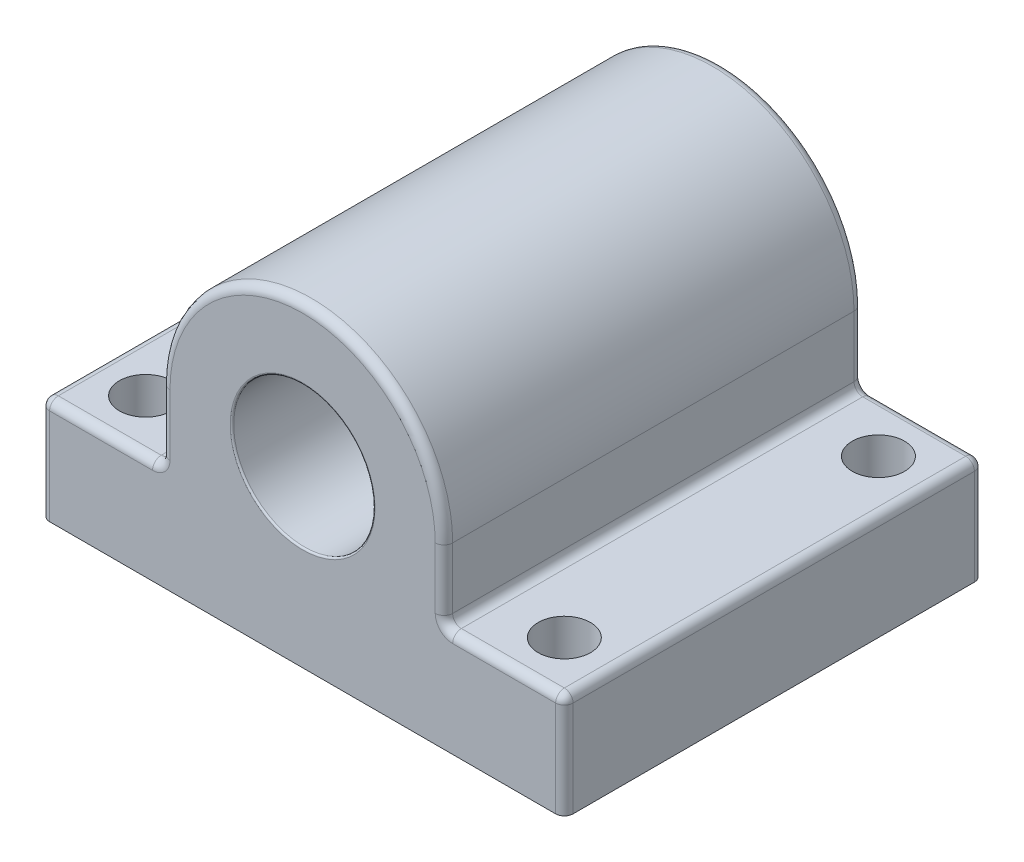
ISO-10303-21;
HEADER;
FILE_DESCRIPTION(('STEP AP214'),'2;1');
FILE_NAME('part.step','',(''),(''),'','','');
FILE_SCHEMA(('AUTOMOTIVE_DESIGN { 1 0 10303 214 1 1 1 1 }'));
ENDSEC;
DATA;
#1=APPLICATION_CONTEXT('core data for automotive mechanical design processes');
#2=APPLICATION_PROTOCOL_DEFINITION('international standard','automotive_design',2000,#1);
#3=PRODUCT_CONTEXT('',#1,'mechanical');
#4=PRODUCT('Part','Part','',(#3));
#5=PRODUCT_RELATED_PRODUCT_CATEGORY('part','',(#4));
#6=PRODUCT_DEFINITION_FORMATION('','',#4);
#7=PRODUCT_DEFINITION_CONTEXT('part definition',#1,'design');
#8=PRODUCT_DEFINITION('design','',#6,#7);
#9=PRODUCT_DEFINITION_SHAPE('','',#8);
#10=(LENGTH_UNIT() NAMED_UNIT(*) SI_UNIT(.MILLI.,.METRE.));
#11=(NAMED_UNIT(*) PLANE_ANGLE_UNIT() SI_UNIT($,.RADIAN.));
#12=(NAMED_UNIT(*) SI_UNIT($,.STERADIAN.) SOLID_ANGLE_UNIT());
#13=UNCERTAINTY_MEASURE_WITH_UNIT(LENGTH_MEASURE(1.E-05),#10,'distance_accuracy_value','');
#14=(GEOMETRIC_REPRESENTATION_CONTEXT(3) GLOBAL_UNCERTAINTY_ASSIGNED_CONTEXT((#13)) GLOBAL_UNIT_ASSIGNED_CONTEXT((#10,
#11,#12)) REPRESENTATION_CONTEXT('',''));
#15=CARTESIAN_POINT('',(0.,0.,0.));
#16=DIRECTION('',(0.,0.,1.));
#17=DIRECTION('',(1.,0.,0.));
#18=AXIS2_PLACEMENT_3D('',#15,#16,#17);
#19=CARTESIAN_POINT('',(8.10000000000001,0.,-12.));
#20=DIRECTION('',(-1.,0.,0.));
#21=DIRECTION('',(0.,-1.,0.));
#22=AXIS2_PLACEMENT_3D('',#19,#20,#21);
#23=PLANE('',#22);
#24=DIRECTION('',(0.,0.,1.));
#25=VECTOR('',#24,1.);
#26=CARTESIAN_POINT('',(8.1,10.,-12.));
#27=LINE('',#26,#25);
#28=CARTESIAN_POINT('',(8.1,10.,-11.5));
#29=VERTEX_POINT('',#28);
#30=CARTESIAN_POINT('',(8.1,10.,11.5));
#31=VERTEX_POINT('',#30);
#32=EDGE_CURVE('E229',#29,#31,#27,.T.);
#33=ORIENTED_EDGE('',*,*,#32,.T.);
#34=DIRECTION('',(0.,-1.,0.));
#35=VECTOR('',#34,1.);
#36=CARTESIAN_POINT('',(8.1,6.,11.5));
#37=LINE('',#36,#35);
#38=CARTESIAN_POINT('',(8.1,6.5,11.5));
#39=VERTEX_POINT('',#38);
#40=EDGE_CURVE('E259',#31,#39,#37,.T.);
#41=ORIENTED_EDGE('',*,*,#40,.T.);
#42=DIRECTION('',(0.,0.,1.));
#43=VECTOR('',#42,1.);
#44=CARTESIAN_POINT('',(8.1,6.5,-12.));
#45=LINE('',#44,#43);
#46=CARTESIAN_POINT('',(8.1,6.5,-11.5));
#47=VERTEX_POINT('',#46);
#48=EDGE_CURVE('E255',#39,#47,#45,.F.);
#49=ORIENTED_EDGE('',*,*,#48,.T.);
#50=DIRECTION('',(0.,-1.,0.));
#51=VECTOR('',#50,1.);
#52=CARTESIAN_POINT('',(8.10000000000001,0.,-11.5));
#53=LINE('',#52,#51);
#54=EDGE_CURVE('E257',#47,#29,#53,.F.);
#55=ORIENTED_EDGE('',*,*,#54,.T.);
#56=EDGE_LOOP('',(#33,#41,#49,#55));
#57=FACE_BOUND('',#56,.T.);
#58=ADVANCED_FACE('F36',(#57),#23,.F.);
#59=CARTESIAN_POINT('',(0.,6.,-12.));
#60=DIRECTION('',(0.,-1.,0.));
#61=DIRECTION('',(0.,0.,-1.));
#62=AXIS2_PLACEMENT_3D('',#59,#60,#61);
#63=PLANE('',#62);
#64=DIRECTION('',(1.,0.,0.));
#65=VECTOR('',#64,1.);
#66=CARTESIAN_POINT('',(15.,6.,11.5));
#67=LINE('',#66,#65);
#68=CARTESIAN_POINT('',(8.6,6.,11.5));
#69=VERTEX_POINT('',#68);
#70=CARTESIAN_POINT('',(14.5,6.,11.5));
#71=VERTEX_POINT('',#70);
#72=EDGE_CURVE('E197',#69,#71,#67,.T.);
#73=ORIENTED_EDGE('',*,*,#72,.T.);
#74=DIRECTION('',(0.,0.,1.));
#75=VECTOR('',#74,1.);
#76=CARTESIAN_POINT('',(14.5,6.,-12.));
#77=LINE('',#76,#75);
#78=CARTESIAN_POINT('',(14.5,6.,-11.5));
#79=VERTEX_POINT('',#78);
#80=EDGE_CURVE('E193',#71,#79,#77,.F.);
#81=ORIENTED_EDGE('',*,*,#80,.T.);
#82=DIRECTION('',(1.,0.,0.));
#83=VECTOR('',#82,1.);
#84=CARTESIAN_POINT('',(0.,6.,-11.5));
#85=LINE('',#84,#83);
#86=CARTESIAN_POINT('',(8.6,6.,-11.5));
#87=VERTEX_POINT('',#86);
#88=EDGE_CURVE('E184',#79,#87,#85,.F.);
#89=ORIENTED_EDGE('',*,*,#88,.T.);
#90=DIRECTION('',(0.,0.,1.));
#91=VECTOR('',#90,1.);
#92=CARTESIAN_POINT('',(8.6,6.,12.));
#93=LINE('',#92,#91);
#94=EDGE_CURVE('E190',#87,#69,#93,.T.);
#95=ORIENTED_EDGE('',*,*,#94,.T.);
#96=EDGE_LOOP('',(#73,#81,#89,#95));
#97=FACE_BOUND('',#96,.T.);
#98=CARTESIAN_POINT('',(12.,5.99999999999999,-9.));
#99=DIRECTION('',(0.,1.,0.));
#100=DIRECTION('',(0.,0.,1.));
#101=AXIS2_PLACEMENT_3D('',#98,#99,#100);
#102=CIRCLE('',#101,1.5);
#103=CARTESIAN_POINT('',(12.,5.99999999999999,-7.5));
#104=VERTEX_POINT('',#103);
#105=EDGE_CURVE('E913',#104,#104,#102,.T.);
#106=ORIENTED_EDGE('',*,*,#105,.F.);
#107=EDGE_LOOP('',(#106));
#108=FACE_BOUND('',#107,.T.);
#109=CARTESIAN_POINT('',(12.,5.99999999999999,9.));
#110=DIRECTION('',(0.,1.,0.));
#111=DIRECTION('',(0.,0.,1.));
#112=AXIS2_PLACEMENT_3D('',#109,#110,#111);
#113=CIRCLE('',#112,1.5);
#114=CARTESIAN_POINT('',(12.,5.99999999999999,10.5));
#115=VERTEX_POINT('',#114);
#116=EDGE_CURVE('E386',#115,#115,#113,.T.);
#117=ORIENTED_EDGE('',*,*,#116,.F.);
#118=EDGE_LOOP('',(#117));
#119=FACE_BOUND('',#118,.T.);
#120=ADVANCED_FACE('F187',(#97,#108,#119),#63,.F.);
#121=CARTESIAN_POINT('',(15.,0.,-12.));
#122=DIRECTION('',(-1.,0.,0.));
#123=DIRECTION('',(0.,-1.,0.));
#124=AXIS2_PLACEMENT_3D('',#121,#122,#123);
#125=PLANE('',#124);
#126=DIRECTION('',(0.,0.,1.));
#127=VECTOR('',#126,1.);
#128=CARTESIAN_POINT('',(15.,0.,-12.));
#129=LINE('',#128,#127);
#130=CARTESIAN_POINT('',(15.,0.,-11.5));
#131=VERTEX_POINT('',#130);
#132=CARTESIAN_POINT('',(15.,0.,11.5));
#133=VERTEX_POINT('',#132);
#134=EDGE_CURVE('E223',#131,#133,#129,.T.);
#135=ORIENTED_EDGE('',*,*,#134,.F.);
#136=DIRECTION('',(0.,-1.,0.));
#137=VECTOR('',#136,1.);
#138=CARTESIAN_POINT('',(15.,0.,-11.5));
#139=LINE('',#138,#137);
#140=CARTESIAN_POINT('',(15.,5.5,-11.5));
#141=VERTEX_POINT('',#140);
#142=EDGE_CURVE('E56',#131,#141,#139,.F.);
#143=ORIENTED_EDGE('',*,*,#142,.T.);
#144=DIRECTION('',(0.,0.,1.));
#145=VECTOR('',#144,1.);
#146=CARTESIAN_POINT('',(15.,5.5,-12.));
#147=LINE('',#146,#145);
#148=CARTESIAN_POINT('',(15.,5.5,11.5));
#149=VERTEX_POINT('',#148);
#150=EDGE_CURVE('E51',#141,#149,#147,.T.);
#151=ORIENTED_EDGE('',*,*,#150,.T.);
#152=DIRECTION('',(0.,-1.,0.));
#153=VECTOR('',#152,1.);
#154=CARTESIAN_POINT('',(15.,0.,11.5));
#155=LINE('',#154,#153);
#156=EDGE_CURVE('E314',#149,#133,#155,.T.);
#157=ORIENTED_EDGE('',*,*,#156,.T.);
#158=EDGE_LOOP('',(#135,#143,#151,#157));
#159=FACE_BOUND('',#158,.T.);
#160=ADVANCED_FACE('F545',(#159),#125,.F.);
#161=CARTESIAN_POINT('',(0.,0.,-12.));
#162=DIRECTION('',(0.,1.,0.));
#163=DIRECTION('',(-1.,0.,0.));
#164=AXIS2_PLACEMENT_3D('',#161,#162,#163);
#165=PLANE('',#164);
#166=CARTESIAN_POINT('',(12.,0.,-9.));
#167=DIRECTION('',(0.,1.,0.));
#168=DIRECTION('',(-1.,0.,0.));
#169=AXIS2_PLACEMENT_3D('',#166,#167,#168);
#170=CIRCLE('',#169,1.5);
#171=CARTESIAN_POINT('',(10.5,0.,-9.));
#172=VERTEX_POINT('',#171);
#173=EDGE_CURVE('E910',#172,#172,#170,.F.);
#174=ORIENTED_EDGE('',*,*,#173,.F.);
#175=EDGE_LOOP('',(#174));
#176=FACE_BOUND('',#175,.T.);
#177=CARTESIAN_POINT('',(-12.,0.,9.));
#178=DIRECTION('',(0.,1.,0.));
#179=DIRECTION('',(-1.,0.,0.));
#180=AXIS2_PLACEMENT_3D('',#177,#178,#179);
#181=CIRCLE('',#180,1.5);
#182=CARTESIAN_POINT('',(-13.5,0.,9.));
#183=VERTEX_POINT('',#182);
#184=EDGE_CURVE('E916',#183,#183,#181,.F.);
#185=ORIENTED_EDGE('',*,*,#184,.F.);
#186=EDGE_LOOP('',(#185));
#187=FACE_BOUND('',#186,.T.);
#188=CARTESIAN_POINT('',(12.,0.,9.));
#189=DIRECTION('',(0.,1.,0.));
#190=DIRECTION('',(-1.,0.,0.));
#191=AXIS2_PLACEMENT_3D('',#188,#189,#190);
#192=CIRCLE('',#191,1.5);
#193=CARTESIAN_POINT('',(10.5,0.,9.));
#194=VERTEX_POINT('',#193);
#195=EDGE_CURVE('E921',#194,#194,#192,.F.);
#196=ORIENTED_EDGE('',*,*,#195,.F.);
#197=EDGE_LOOP('',(#196));
#198=FACE_BOUND('',#197,.T.);
#199=CARTESIAN_POINT('',(-12.,0.,-9.));
#200=DIRECTION('',(0.,1.,0.));
#201=DIRECTION('',(-1.,0.,0.));
#202=AXIS2_PLACEMENT_3D('',#199,#200,#201);
#203=CIRCLE('',#202,1.5);
#204=CARTESIAN_POINT('',(-13.5,0.,-9.));
#205=VERTEX_POINT('',#204);
#206=EDGE_CURVE('E450',#205,#205,#203,.F.);
#207=ORIENTED_EDGE('',*,*,#206,.F.);
#208=EDGE_LOOP('',(#207));
#209=FACE_BOUND('',#208,.T.);
#210=DIRECTION('',(0.,0.,1.));
#211=VECTOR('',#210,1.);
#212=CARTESIAN_POINT('',(-15.,0.,-12.));
#213=LINE('',#212,#211);
#214=CARTESIAN_POINT('',(-15.,0.,-11.5));
#215=VERTEX_POINT('',#214);
#216=CARTESIAN_POINT('',(-15.,0.,11.5));
#217=VERTEX_POINT('',#216);
#218=EDGE_CURVE('E226',#215,#217,#213,.T.);
#219=ORIENTED_EDGE('',*,*,#218,.F.);
#220=CARTESIAN_POINT('',(-14.5,0.,-11.5));
#221=DIRECTION('',(0.,1.,0.));
#222=DIRECTION('',(-1.,0.,0.));
#223=AXIS2_PLACEMENT_3D('',#220,#221,#222);
#224=CIRCLE('',#223,0.5);
#225=CARTESIAN_POINT('',(-14.5,0.,-12.));
#226=VERTEX_POINT('',#225);
#227=EDGE_CURVE('E311',#215,#226,#224,.F.);
#228=ORIENTED_EDGE('',*,*,#227,.T.);
#229=DIRECTION('',(-1.,0.,0.));
#230=VECTOR('',#229,1.);
#231=CARTESIAN_POINT('',(0.,0.,-12.));
#232=LINE('',#231,#230);
#233=CARTESIAN_POINT('',(14.5,0.,-12.));
#234=VERTEX_POINT('',#233);
#235=EDGE_CURVE('E449',#234,#226,#232,.T.);
#236=ORIENTED_EDGE('',*,*,#235,.F.);
#237=CARTESIAN_POINT('',(14.5,0.,-11.5));
#238=DIRECTION('',(0.,1.,0.));
#239=DIRECTION('',(-1.,0.,0.));
#240=AXIS2_PLACEMENT_3D('',#237,#238,#239);
#241=CIRCLE('',#240,0.5);
#242=EDGE_CURVE('E309',#234,#131,#241,.F.);
#243=ORIENTED_EDGE('',*,*,#242,.T.);
#244=ORIENTED_EDGE('',*,*,#134,.T.);
#245=CARTESIAN_POINT('',(14.5,0.,11.5));
#246=DIRECTION('',(0.,1.,0.));
#247=DIRECTION('',(-1.,0.,0.));
#248=AXIS2_PLACEMENT_3D('',#245,#246,#247);
#249=CIRCLE('',#248,0.5);
#250=CARTESIAN_POINT('',(14.5,0.,12.));
#251=VERTEX_POINT('',#250);
#252=EDGE_CURVE('E307',#133,#251,#249,.F.);
#253=ORIENTED_EDGE('',*,*,#252,.T.);
#254=DIRECTION('',(-1.,0.,0.));
#255=VECTOR('',#254,1.);
#256=CARTESIAN_POINT('',(0.,0.,12.));
#257=LINE('',#256,#255);
#258=CARTESIAN_POINT('',(-14.5,0.,12.));
#259=VERTEX_POINT('',#258);
#260=EDGE_CURVE('E445',#251,#259,#257,.T.);
#261=ORIENTED_EDGE('',*,*,#260,.T.);
#262=CARTESIAN_POINT('',(-14.5,0.,11.5));
#263=DIRECTION('',(0.,1.,0.));
#264=DIRECTION('',(-1.,0.,0.));
#265=AXIS2_PLACEMENT_3D('',#262,#263,#264);
#266=CIRCLE('',#265,0.5);
#267=EDGE_CURVE('E305',#259,#217,#266,.F.);
#268=ORIENTED_EDGE('',*,*,#267,.T.);
#269=EDGE_LOOP('',(#219,#228,#236,#243,#244,#253,#261,#268));
#270=FACE_BOUND('',#269,.T.);
#271=ADVANCED_FACE('F522',(#176,#187,#198,#209,#270),#165,.F.);
#272=CARTESIAN_POINT('',(-15.,0.,-12.));
#273=DIRECTION('',(1.,0.,0.));
#274=DIRECTION('',(0.,0.,-1.));
#275=AXIS2_PLACEMENT_3D('',#272,#273,#274);
#276=PLANE('',#275);
#277=DIRECTION('',(0.,0.,1.));
#278=VECTOR('',#277,1.);
#279=CARTESIAN_POINT('',(-15.,5.5,-12.));
#280=LINE('',#279,#278);
#281=CARTESIAN_POINT('',(-15.,5.5,11.5));
#282=VERTEX_POINT('',#281);
#283=CARTESIAN_POINT('',(-15.,5.5,-11.5));
#284=VERTEX_POINT('',#283);
#285=EDGE_CURVE('E299',#282,#284,#280,.F.);
#286=ORIENTED_EDGE('',*,*,#285,.T.);
#287=DIRECTION('',(0.,1.,0.));
#288=VECTOR('',#287,1.);
#289=CARTESIAN_POINT('',(-15.,0.,-11.5));
#290=LINE('',#289,#288);
#291=EDGE_CURVE('E303',#284,#215,#290,.F.);
#292=ORIENTED_EDGE('',*,*,#291,.T.);
#293=ORIENTED_EDGE('',*,*,#218,.T.);
#294=DIRECTION('',(0.,1.,0.));
#295=VECTOR('',#294,1.);
#296=CARTESIAN_POINT('',(-15.,6.,11.5));
#297=LINE('',#296,#295);
#298=EDGE_CURVE('E301',#217,#282,#297,.T.);
#299=ORIENTED_EDGE('',*,*,#298,.T.);
#300=EDGE_LOOP('',(#286,#292,#293,#299));
#301=FACE_BOUND('',#300,.T.);
#302=ADVANCED_FACE('F525',(#301),#276,.F.);
#303=CARTESIAN_POINT('',(0.,5.99999999999999,-12.));
#304=DIRECTION('',(0.,-1.,0.));
#305=DIRECTION('',(1.,0.,0.));
#306=AXIS2_PLACEMENT_3D('',#303,#304,#305);
#307=PLANE('',#306);
#308=DIRECTION('',(0.,0.,1.));
#309=VECTOR('',#308,1.);
#310=CARTESIAN_POINT('',(-8.6,5.99999999999999,-12.));
#311=LINE('',#310,#309);
#312=CARTESIAN_POINT('',(-8.6,5.99999999999999,11.5));
#313=VERTEX_POINT('',#312);
#314=CARTESIAN_POINT('',(-8.6,5.99999999999999,-11.5));
#315=VERTEX_POINT('',#314);
#316=EDGE_CURVE('E284',#313,#315,#311,.F.);
#317=ORIENTED_EDGE('',*,*,#316,.T.);
#318=DIRECTION('',(1.,0.,0.));
#319=VECTOR('',#318,1.);
#320=CARTESIAN_POINT('',(0.,5.99999999999999,-11.5));
#321=LINE('',#320,#319);
#322=CARTESIAN_POINT('',(-14.5,6.,-11.5));
#323=VERTEX_POINT('',#322);
#324=EDGE_CURVE('E290',#315,#323,#321,.F.);
#325=ORIENTED_EDGE('',*,*,#324,.T.);
#326=DIRECTION('',(0.,0.,1.));
#327=VECTOR('',#326,1.);
#328=CARTESIAN_POINT('',(-14.5,6.,-12.));
#329=LINE('',#328,#327);
#330=CARTESIAN_POINT('',(-14.5,6.,11.5));
#331=VERTEX_POINT('',#330);
#332=EDGE_CURVE('E288',#323,#331,#329,.T.);
#333=ORIENTED_EDGE('',*,*,#332,.T.);
#334=DIRECTION('',(1.,0.,0.));
#335=VECTOR('',#334,1.);
#336=CARTESIAN_POINT('',(-8.1,5.99999999999999,11.5));
#337=LINE('',#336,#335);
#338=EDGE_CURVE('E286',#331,#313,#337,.T.);
#339=ORIENTED_EDGE('',*,*,#338,.T.);
#340=EDGE_LOOP('',(#317,#325,#333,#339));
#341=FACE_BOUND('',#340,.T.);
#342=CARTESIAN_POINT('',(-12.,5.99999999999999,9.));
#343=DIRECTION('',(0.,1.,0.));
#344=DIRECTION('',(0.,0.,1.));
#345=AXIS2_PLACEMENT_3D('',#342,#343,#344);
#346=CIRCLE('',#345,1.5);
#347=CARTESIAN_POINT('',(-12.,5.99999999999999,10.5));
#348=VERTEX_POINT('',#347);
#349=EDGE_CURVE('E919',#348,#348,#346,.T.);
#350=ORIENTED_EDGE('',*,*,#349,.F.);
#351=EDGE_LOOP('',(#350));
#352=FACE_BOUND('',#351,.T.);
#353=CARTESIAN_POINT('',(-12.,5.99999999999999,-9.));
#354=DIRECTION('',(0.,1.,0.));
#355=DIRECTION('',(0.,0.,1.));
#356=AXIS2_PLACEMENT_3D('',#353,#354,#355);
#357=CIRCLE('',#356,1.5);
#358=CARTESIAN_POINT('',(-12.,5.99999999999999,-7.5));
#359=VERTEX_POINT('',#358);
#360=EDGE_CURVE('E454',#359,#359,#357,.T.);
#361=ORIENTED_EDGE('',*,*,#360,.F.);
#362=EDGE_LOOP('',(#361));
#363=FACE_BOUND('',#362,.T.);
#364=ADVANCED_FACE('F540',(#341,#352,#363),#307,.F.);
#365=CARTESIAN_POINT('',(-8.10000000000001,0.,-12.));
#366=DIRECTION('',(1.,0.,0.));
#367=DIRECTION('',(0.,1.,0.));
#368=AXIS2_PLACEMENT_3D('',#365,#366,#367);
#369=PLANE('',#368);
#370=DIRECTION('',(0.,0.,1.));
#371=VECTOR('',#370,1.);
#372=CARTESIAN_POINT('',(-8.1,6.5,12.));
#373=LINE('',#372,#371);
#374=CARTESIAN_POINT('',(-8.1,6.5,-11.5));
#375=VERTEX_POINT('',#374);
#376=CARTESIAN_POINT('',(-8.1,6.5,11.5));
#377=VERTEX_POINT('',#376);
#378=EDGE_CURVE('E293',#375,#377,#373,.T.);
#379=ORIENTED_EDGE('',*,*,#378,.T.);
#380=DIRECTION('',(0.,1.,0.));
#381=VECTOR('',#380,1.);
#382=CARTESIAN_POINT('',(-8.1,10.,11.5));
#383=LINE('',#382,#381);
#384=CARTESIAN_POINT('',(-8.1,10.,11.5));
#385=VERTEX_POINT('',#384);
#386=EDGE_CURVE('E297',#377,#385,#383,.T.);
#387=ORIENTED_EDGE('',*,*,#386,.T.);
#388=DIRECTION('',(0.,0.,1.));
#389=VECTOR('',#388,1.);
#390=CARTESIAN_POINT('',(-8.1,10.,-12.));
#391=LINE('',#390,#389);
#392=CARTESIAN_POINT('',(-8.1,10.,-11.5));
#393=VERTEX_POINT('',#392);
#394=EDGE_CURVE('E458',#393,#385,#391,.T.);
#395=ORIENTED_EDGE('',*,*,#394,.F.);
#396=DIRECTION('',(0.,1.,0.));
#397=VECTOR('',#396,1.);
#398=CARTESIAN_POINT('',(-8.10000000000001,0.,-11.5));
#399=LINE('',#398,#397);
#400=EDGE_CURVE('E295',#393,#375,#399,.F.);
#401=ORIENTED_EDGE('',*,*,#400,.T.);
#402=EDGE_LOOP('',(#379,#387,#395,#401));
#403=FACE_BOUND('',#402,.T.);
#404=ADVANCED_FACE('F407',(#403),#369,.F.);
#405=CARTESIAN_POINT('',(0.,10.,-12.));
#406=DIRECTION('',(0.,0.,1.));
#407=DIRECTION('',(1.,0.,0.));
#408=AXIS2_PLACEMENT_3D('',#405,#406,#407);
#409=CYLINDRICAL_SURFACE('',#408,4.05);
#410=CARTESIAN_POINT('',(0.,10.,11.9));
#411=DIRECTION('',(0.,0.,1.));
#412=DIRECTION('',(1.,0.,0.));
#413=AXIS2_PLACEMENT_3D('',#410,#411,#412);
#414=CIRCLE('',#413,4.05);
#415=CARTESIAN_POINT('',(4.04999999999999,10.,11.9));
#416=VERTEX_POINT('',#415);
#417=EDGE_CURVE('E389',#416,#416,#414,.T.);
#418=ORIENTED_EDGE('',*,*,#417,.T.);
#419=EDGE_LOOP('',(#418));
#420=FACE_BOUND('',#419,.T.);
#421=CARTESIAN_POINT('',(0.,10.,-11.9));
#422=DIRECTION('',(0.,0.,1.));
#423=DIRECTION('',(1.,0.,0.));
#424=AXIS2_PLACEMENT_3D('',#421,#422,#423);
#425=CIRCLE('',#424,4.05);
#426=CARTESIAN_POINT('',(4.04999999999999,10.,-11.9));
#427=VERTEX_POINT('',#426);
#428=EDGE_CURVE('E317',#427,#427,#425,.F.);
#429=ORIENTED_EDGE('',*,*,#428,.T.);
#430=EDGE_LOOP('',(#429));
#431=FACE_BOUND('',#430,.T.);
#432=ADVANCED_FACE('F403',(#420,#431),#409,.F.);
#433=CARTESIAN_POINT('',(0.,10.,-12.));
#434=DIRECTION('',(0.,0.,1.));
#435=DIRECTION('',(1.,0.,0.));
#436=AXIS2_PLACEMENT_3D('',#433,#434,#435);
#437=CYLINDRICAL_SURFACE('',#436,8.1);
#438=ORIENTED_EDGE('',*,*,#394,.T.);
#439=CARTESIAN_POINT('',(0.,10.,11.5));
#440=DIRECTION('',(0.,0.,1.));
#441=DIRECTION('',(1.,0.,0.));
#442=AXIS2_PLACEMENT_3D('',#439,#440,#441);
#443=CIRCLE('',#442,8.1);
#444=EDGE_CURVE('E264',#385,#31,#443,.F.);
#445=ORIENTED_EDGE('',*,*,#444,.T.);
#446=ORIENTED_EDGE('',*,*,#32,.F.);
#447=CARTESIAN_POINT('',(0.,10.,-11.5));
#448=DIRECTION('',(0.,0.,1.));
#449=DIRECTION('',(1.,0.,0.));
#450=AXIS2_PLACEMENT_3D('',#447,#448,#449);
#451=CIRCLE('',#450,8.1);
#452=EDGE_CURVE('E262',#29,#393,#451,.T.);
#453=ORIENTED_EDGE('',*,*,#452,.T.);
#454=EDGE_LOOP('',(#438,#445,#446,#453));
#455=FACE_BOUND('',#454,.T.);
#456=ADVANCED_FACE('F406',(#455),#437,.T.);
#457=CARTESIAN_POINT('',(0.,0.,-12.));
#458=DIRECTION('',(0.,0.,1.));
#459=DIRECTION('',(1.,0.,0.));
#460=AXIS2_PLACEMENT_3D('',#457,#458,#459);
#461=PLANE('',#460);
#462=CARTESIAN_POINT('',(0.,10.,-12.));
#463=DIRECTION('',(0.,0.,1.));
#464=DIRECTION('',(1.,0.,0.));
#465=AXIS2_PLACEMENT_3D('',#462,#463,#464);
#466=CIRCLE('',#465,4.15);
#467=CARTESIAN_POINT('',(4.15,10.,-12.));
#468=VERTEX_POINT('',#467);
#469=EDGE_CURVE('E11',#468,#468,#466,.T.);
#470=ORIENTED_EDGE('',*,*,#469,.T.);
#471=EDGE_LOOP('',(#470));
#472=FACE_BOUND('',#471,.T.);
#473=DIRECTION('',(1.,0.,0.));
#474=VECTOR('',#473,1.);
#475=CARTESIAN_POINT('',(0.,5.5,-12.));
#476=LINE('',#475,#474);
#477=CARTESIAN_POINT('',(8.6,5.5,-12.));
#478=VERTEX_POINT('',#477);
#479=CARTESIAN_POINT('',(14.5,5.5,-12.));
#480=VERTEX_POINT('',#479);
#481=EDGE_CURVE('E204',#478,#480,#476,.T.);
#482=ORIENTED_EDGE('',*,*,#481,.T.);
#483=DIRECTION('',(0.,-1.,0.));
#484=VECTOR('',#483,1.);
#485=CARTESIAN_POINT('',(14.5,0.,-12.));
#486=LINE('',#485,#484);
#487=EDGE_CURVE('E282',#480,#234,#486,.T.);
#488=ORIENTED_EDGE('',*,*,#487,.T.);
#489=ORIENTED_EDGE('',*,*,#235,.T.);
#490=DIRECTION('',(0.,1.,0.));
#491=VECTOR('',#490,1.);
#492=CARTESIAN_POINT('',(-14.5,0.,-12.));
#493=LINE('',#492,#491);
#494=CARTESIAN_POINT('',(-14.5,5.5,-12.));
#495=VERTEX_POINT('',#494);
#496=EDGE_CURVE('E277',#226,#495,#493,.T.);
#497=ORIENTED_EDGE('',*,*,#496,.T.);
#498=DIRECTION('',(1.,0.,0.));
#499=VECTOR('',#498,1.);
#500=CARTESIAN_POINT('',(0.,5.49999999999999,-12.));
#501=LINE('',#500,#499);
#502=CARTESIAN_POINT('',(-8.6,5.49999999999999,-12.));
#503=VERTEX_POINT('',#502);
#504=EDGE_CURVE('E275',#495,#503,#501,.T.);
#505=ORIENTED_EDGE('',*,*,#504,.T.);
#506=CARTESIAN_POINT('',(-8.6,6.5,-12.));
#507=DIRECTION('',(0.,0.,1.));
#508=DIRECTION('',(1.,0.,0.));
#509=AXIS2_PLACEMENT_3D('',#506,#507,#508);
#510=CIRCLE('',#509,1.);
#511=CARTESIAN_POINT('',(-7.6,6.5,-12.));
#512=VERTEX_POINT('',#511);
#513=EDGE_CURVE('E272',#512,#503,#510,.F.);
#514=ORIENTED_EDGE('',*,*,#513,.F.);
#515=DIRECTION('',(0.,1.,0.));
#516=VECTOR('',#515,1.);
#517=CARTESIAN_POINT('',(-7.60000000000001,0.,-12.));
#518=LINE('',#517,#516);
#519=CARTESIAN_POINT('',(-7.6,10.,-12.));
#520=VERTEX_POINT('',#519);
#521=EDGE_CURVE('E266',#512,#520,#518,.T.);
#522=ORIENTED_EDGE('',*,*,#521,.T.);
#523=CARTESIAN_POINT('',(0.,10.,-12.));
#524=DIRECTION('',(0.,0.,1.));
#525=DIRECTION('',(1.,0.,0.));
#526=AXIS2_PLACEMENT_3D('',#523,#524,#525);
#527=CIRCLE('',#526,7.6);
#528=CARTESIAN_POINT('',(7.59999999999999,10.,-12.));
#529=VERTEX_POINT('',#528);
#530=EDGE_CURVE('E268',#520,#529,#527,.F.);
#531=ORIENTED_EDGE('',*,*,#530,.T.);
#532=DIRECTION('',(0.,-1.,0.));
#533=VECTOR('',#532,1.);
#534=CARTESIAN_POINT('',(7.60000000000001,0.,-12.));
#535=LINE('',#534,#533);
#536=CARTESIAN_POINT('',(7.6,6.5,-12.));
#537=VERTEX_POINT('',#536);
#538=EDGE_CURVE('E270',#529,#537,#535,.T.);
#539=ORIENTED_EDGE('',*,*,#538,.T.);
#540=CARTESIAN_POINT('',(8.6,6.5,-12.));
#541=DIRECTION('',(0.,0.,1.));
#542=DIRECTION('',(1.,0.,0.));
#543=AXIS2_PLACEMENT_3D('',#540,#541,#542);
#544=CIRCLE('',#543,1.);
#545=EDGE_CURVE('E279',#478,#537,#544,.F.);
#546=ORIENTED_EDGE('',*,*,#545,.F.);
#547=EDGE_LOOP('',(#482,#488,#489,#497,#505,#514,#522,#531,#539,#546));
#548=FACE_BOUND('',#547,.T.);
#549=ADVANCED_FACE('F415',(#472,#548),#461,.F.);
#550=CARTESIAN_POINT('',(0.,0.,12.));
#551=DIRECTION('',(0.,0.,1.));
#552=DIRECTION('',(1.,0.,0.));
#553=AXIS2_PLACEMENT_3D('',#550,#551,#552);
#554=PLANE('',#553);
#555=CARTESIAN_POINT('',(0.,10.,12.));
#556=DIRECTION('',(0.,0.,1.));
#557=DIRECTION('',(1.,0.,0.));
#558=AXIS2_PLACEMENT_3D('',#555,#556,#557);
#559=CIRCLE('',#558,4.15);
#560=CARTESIAN_POINT('',(4.15,10.,12.));
#561=VERTEX_POINT('',#560);
#562=EDGE_CURVE('E44',#561,#561,#559,.F.);
#563=ORIENTED_EDGE('',*,*,#562,.T.);
#564=EDGE_LOOP('',(#563));
#565=FACE_BOUND('',#564,.T.);
#566=ORIENTED_EDGE('',*,*,#260,.F.);
#567=DIRECTION('',(0.,-1.,0.));
#568=VECTOR('',#567,1.);
#569=CARTESIAN_POINT('',(14.5,6.,12.));
#570=LINE('',#569,#568);
#571=CARTESIAN_POINT('',(14.5,5.5,12.));
#572=VERTEX_POINT('',#571);
#573=EDGE_CURVE('E253',#251,#572,#570,.F.);
#574=ORIENTED_EDGE('',*,*,#573,.T.);
#575=DIRECTION('',(1.,0.,0.));
#576=VECTOR('',#575,1.);
#577=CARTESIAN_POINT('',(8.1,5.5,12.));
#578=LINE('',#577,#576);
#579=CARTESIAN_POINT('',(8.6,5.5,12.));
#580=VERTEX_POINT('',#579);
#581=EDGE_CURVE('E250',#572,#580,#578,.F.);
#582=ORIENTED_EDGE('',*,*,#581,.T.);
#583=CARTESIAN_POINT('',(8.6,6.5,12.));
#584=DIRECTION('',(0.,0.,1.));
#585=DIRECTION('',(1.,0.,0.));
#586=AXIS2_PLACEMENT_3D('',#583,#584,#585);
#587=CIRCLE('',#586,1.);
#588=CARTESIAN_POINT('',(7.6,6.5,12.));
#589=VERTEX_POINT('',#588);
#590=EDGE_CURVE('E247',#589,#580,#587,.T.);
#591=ORIENTED_EDGE('',*,*,#590,.F.);
#592=DIRECTION('',(0.,-1.,0.));
#593=VECTOR('',#592,1.);
#594=CARTESIAN_POINT('',(7.6,10.,12.));
#595=LINE('',#594,#593);
#596=CARTESIAN_POINT('',(7.59999999999999,10.,12.));
#597=VERTEX_POINT('',#596);
#598=EDGE_CURVE('E245',#589,#597,#595,.F.);
#599=ORIENTED_EDGE('',*,*,#598,.T.);
#600=CARTESIAN_POINT('',(0.,10.,12.));
#601=DIRECTION('',(0.,0.,1.));
#602=DIRECTION('',(1.,0.,0.));
#603=AXIS2_PLACEMENT_3D('',#600,#601,#602);
#604=CIRCLE('',#603,7.6);
#605=CARTESIAN_POINT('',(-7.6,10.,12.));
#606=VERTEX_POINT('',#605);
#607=EDGE_CURVE('E243',#597,#606,#604,.T.);
#608=ORIENTED_EDGE('',*,*,#607,.T.);
#609=DIRECTION('',(0.,1.,0.));
#610=VECTOR('',#609,1.);
#611=CARTESIAN_POINT('',(-7.6,5.99999999999999,12.));
#612=LINE('',#611,#610);
#613=CARTESIAN_POINT('',(-7.6,6.5,12.));
#614=VERTEX_POINT('',#613);
#615=EDGE_CURVE('E241',#606,#614,#612,.F.);
#616=ORIENTED_EDGE('',*,*,#615,.T.);
#617=CARTESIAN_POINT('',(-8.6,6.5,12.));
#618=DIRECTION('',(0.,0.,1.));
#619=DIRECTION('',(1.,0.,0.));
#620=AXIS2_PLACEMENT_3D('',#617,#618,#619);
#621=CIRCLE('',#620,1.);
#622=CARTESIAN_POINT('',(-8.6,5.49999999999999,12.));
#623=VERTEX_POINT('',#622);
#624=EDGE_CURVE('E238',#623,#614,#621,.T.);
#625=ORIENTED_EDGE('',*,*,#624,.F.);
#626=DIRECTION('',(1.,0.,0.));
#627=VECTOR('',#626,1.);
#628=CARTESIAN_POINT('',(-15.,5.5,12.));
#629=LINE('',#628,#627);
#630=CARTESIAN_POINT('',(-14.5,5.5,12.));
#631=VERTEX_POINT('',#630);
#632=EDGE_CURVE('E234',#623,#631,#629,.F.);
#633=ORIENTED_EDGE('',*,*,#632,.T.);
#634=DIRECTION('',(0.,1.,0.));
#635=VECTOR('',#634,1.);
#636=CARTESIAN_POINT('',(-14.5,0.,12.));
#637=LINE('',#636,#635);
#638=EDGE_CURVE('E236',#631,#259,#637,.F.);
#639=ORIENTED_EDGE('',*,*,#638,.T.);
#640=EDGE_LOOP('',(#566,#574,#582,#591,#599,#608,#616,#625,#633,#639));
#641=FACE_BOUND('',#640,.T.);
#642=ADVANCED_FACE('F394',(#565,#641),#554,.T.);
#643=CARTESIAN_POINT('',(-12.,-0.00100000000000534,-9.));
#644=DIRECTION('',(0.,1.,0.));
#645=DIRECTION('',(0.,0.,1.));
#646=AXIS2_PLACEMENT_3D('',#643,#644,#645);
#647=CYLINDRICAL_SURFACE('',#646,1.5);
#648=ORIENTED_EDGE('',*,*,#360,.T.);
#649=EDGE_LOOP('',(#648));
#650=FACE_BOUND('',#649,.T.);
#651=ORIENTED_EDGE('',*,*,#206,.T.);
#652=EDGE_LOOP('',(#651));
#653=FACE_BOUND('',#652,.T.);
#654=ADVANCED_FACE('F632',(#650,#653),#647,.F.);
#655=CARTESIAN_POINT('',(-12.,-0.00100000000000534,9.));
#656=DIRECTION('',(0.,1.,0.));
#657=DIRECTION('',(0.,0.,1.));
#658=AXIS2_PLACEMENT_3D('',#655,#656,#657);
#659=CYLINDRICAL_SURFACE('',#658,1.5);
#660=ORIENTED_EDGE('',*,*,#349,.T.);
#661=EDGE_LOOP('',(#660));
#662=FACE_BOUND('',#661,.T.);
#663=ORIENTED_EDGE('',*,*,#184,.T.);
#664=EDGE_LOOP('',(#663));
#665=FACE_BOUND('',#664,.T.);
#666=ADVANCED_FACE('F624',(#662,#665),#659,.F.);
#667=CARTESIAN_POINT('',(12.,-0.00100000000000534,9.));
#668=DIRECTION('',(0.,1.,0.));
#669=DIRECTION('',(0.,0.,1.));
#670=AXIS2_PLACEMENT_3D('',#667,#668,#669);
#671=CYLINDRICAL_SURFACE('',#670,1.5);
#672=ORIENTED_EDGE('',*,*,#116,.T.);
#673=EDGE_LOOP('',(#672));
#674=FACE_BOUND('',#673,.T.);
#675=ORIENTED_EDGE('',*,*,#195,.T.);
#676=EDGE_LOOP('',(#675));
#677=FACE_BOUND('',#676,.T.);
#678=ADVANCED_FACE('F618',(#674,#677),#671,.F.);
#679=CARTESIAN_POINT('',(12.,-0.00100000000000534,-9.));
#680=DIRECTION('',(0.,1.,0.));
#681=DIRECTION('',(0.,0.,1.));
#682=AXIS2_PLACEMENT_3D('',#679,#680,#681);
#683=CYLINDRICAL_SURFACE('',#682,1.5);
#684=ORIENTED_EDGE('',*,*,#105,.T.);
#685=EDGE_LOOP('',(#684));
#686=FACE_BOUND('',#685,.T.);
#687=ORIENTED_EDGE('',*,*,#173,.T.);
#688=EDGE_LOOP('',(#687));
#689=FACE_BOUND('',#688,.T.);
#690=ADVANCED_FACE('F614',(#686,#689),#683,.F.);
#691=CARTESIAN_POINT('',(-14.5,0.,-11.5));
#692=DIRECTION('',(0.,1.,0.));
#693=DIRECTION('',(0.,0.,1.));
#694=AXIS2_PLACEMENT_3D('',#691,#692,#693);
#695=CYLINDRICAL_SURFACE('',#694,0.5);
#696=CARTESIAN_POINT('',(-14.5,5.5,-11.5));
#697=DIRECTION('',(0.,1.,0.));
#698=DIRECTION('',(0.,0.,1.));
#699=AXIS2_PLACEMENT_3D('',#696,#697,#698);
#700=CIRCLE('',#699,0.5);
#701=EDGE_CURVE('E383',#495,#284,#700,.T.);
#702=ORIENTED_EDGE('',*,*,#701,.F.);
#703=ORIENTED_EDGE('',*,*,#496,.F.);
#704=ORIENTED_EDGE('',*,*,#227,.F.);
#705=ORIENTED_EDGE('',*,*,#291,.F.);
#706=EDGE_LOOP('',(#702,#703,#704,#705));
#707=FACE_BOUND('',#706,.T.);
#708=ADVANCED_FACE('F530',(#707),#695,.T.);
#709=CARTESIAN_POINT('',(-14.5,5.5,-11.5));
#710=DIRECTION('',(0.,0.,1.));
#711=DIRECTION('',(1.,0.,0.));
#712=AXIS2_PLACEMENT_3D('',#709,#710,#711);
#713=SPHERICAL_SURFACE('',#712,0.5);
#714=CARTESIAN_POINT('',(-14.5,5.5,-11.5));
#715=DIRECTION('',(-1.,0.,0.));
#716=DIRECTION('',(0.,0.,1.));
#717=AXIS2_PLACEMENT_3D('',#714,#715,#716);
#718=CIRCLE('',#717,0.5);
#719=EDGE_CURVE('E377',#495,#323,#718,.F.);
#720=ORIENTED_EDGE('',*,*,#719,.F.);
#721=ORIENTED_EDGE('',*,*,#701,.T.);
#722=CARTESIAN_POINT('',(-14.5,5.5,-11.5));
#723=DIRECTION('',(0.,0.,-1.));
#724=DIRECTION('',(-1.,0.,0.));
#725=AXIS2_PLACEMENT_3D('',#722,#723,#724);
#726=CIRCLE('',#725,0.5);
#727=EDGE_CURVE('E380',#323,#284,#726,.F.);
#728=ORIENTED_EDGE('',*,*,#727,.F.);
#729=EDGE_LOOP('',(#720,#721,#728));
#730=FACE_BOUND('',#729,.T.);
#731=ADVANCED_FACE('F535',(#730),#713,.T.);
#732=CARTESIAN_POINT('',(-14.5,0.,11.5));
#733=DIRECTION('',(0.,-1.,0.));
#734=DIRECTION('',(0.,0.,-1.));
#735=AXIS2_PLACEMENT_3D('',#732,#733,#734);
#736=CYLINDRICAL_SURFACE('',#735,0.5);
#737=ORIENTED_EDGE('',*,*,#267,.F.);
#738=ORIENTED_EDGE('',*,*,#638,.F.);
#739=CARTESIAN_POINT('',(-14.5,5.5,11.5));
#740=DIRECTION('',(0.,1.,0.));
#741=DIRECTION('',(0.,0.,1.));
#742=AXIS2_PLACEMENT_3D('',#739,#740,#741);
#743=CIRCLE('',#742,0.5);
#744=EDGE_CURVE('E374',#282,#631,#743,.T.);
#745=ORIENTED_EDGE('',*,*,#744,.F.);
#746=ORIENTED_EDGE('',*,*,#298,.F.);
#747=EDGE_LOOP('',(#737,#738,#745,#746));
#748=FACE_BOUND('',#747,.T.);
#749=ADVANCED_FACE('F520',(#748),#736,.T.);
#750=CARTESIAN_POINT('',(-14.5,5.5,-12.));
#751=DIRECTION('',(0.,0.,1.));
#752=DIRECTION('',(1.,0.,0.));
#753=AXIS2_PLACEMENT_3D('',#750,#751,#752);
#754=CYLINDRICAL_SURFACE('',#753,0.5);
#755=ORIENTED_EDGE('',*,*,#727,.T.);
#756=ORIENTED_EDGE('',*,*,#285,.F.);
#757=CARTESIAN_POINT('',(-14.5,5.5,11.5));
#758=DIRECTION('',(0.,0.,1.));
#759=DIRECTION('',(1.,0.,0.));
#760=AXIS2_PLACEMENT_3D('',#757,#758,#759);
#761=CIRCLE('',#760,0.5);
#762=EDGE_CURVE('E371',#331,#282,#761,.T.);
#763=ORIENTED_EDGE('',*,*,#762,.F.);
#764=ORIENTED_EDGE('',*,*,#332,.F.);
#765=EDGE_LOOP('',(#755,#756,#763,#764));
#766=FACE_BOUND('',#765,.T.);
#767=ADVANCED_FACE('F538',(#766),#754,.T.);
#768=CARTESIAN_POINT('',(0.,5.49999999999999,-11.5));
#769=DIRECTION('',(1.,0.,0.));
#770=DIRECTION('',(0.,1.,0.));
#771=AXIS2_PLACEMENT_3D('',#768,#769,#770);
#772=CYLINDRICAL_SURFACE('',#771,0.5);
#773=ORIENTED_EDGE('',*,*,#719,.T.);
#774=ORIENTED_EDGE('',*,*,#324,.F.);
#775=CARTESIAN_POINT('',(-8.6,5.49999999999999,-11.5));
#776=DIRECTION('',(1.,0.,0.));
#777=DIRECTION('',(0.,0.,-1.));
#778=AXIS2_PLACEMENT_3D('',#775,#776,#777);
#779=CIRCLE('',#778,0.5);
#780=EDGE_CURVE('E368',#503,#315,#779,.T.);
#781=ORIENTED_EDGE('',*,*,#780,.F.);
#782=ORIENTED_EDGE('',*,*,#504,.F.);
#783=EDGE_LOOP('',(#773,#774,#781,#782));
#784=FACE_BOUND('',#783,.T.);
#785=ADVANCED_FACE('F544',(#784),#772,.T.);
#786=CARTESIAN_POINT('',(-14.5,5.5,11.5));
#787=DIRECTION('',(0.,0.,1.));
#788=DIRECTION('',(1.,0.,0.));
#789=AXIS2_PLACEMENT_3D('',#786,#787,#788);
#790=SPHERICAL_SURFACE('',#789,0.5);
#791=ORIENTED_EDGE('',*,*,#762,.T.);
#792=ORIENTED_EDGE('',*,*,#744,.T.);
#793=CARTESIAN_POINT('',(-14.5,5.5,11.5));
#794=DIRECTION('',(-1.,0.,0.));
#795=DIRECTION('',(0.,0.,1.));
#796=AXIS2_PLACEMENT_3D('',#793,#794,#795);
#797=CIRCLE('',#796,0.5);
#798=EDGE_CURVE('E365',#331,#631,#797,.F.);
#799=ORIENTED_EDGE('',*,*,#798,.F.);
#800=EDGE_LOOP('',(#791,#792,#799));
#801=FACE_BOUND('',#800,.T.);
#802=ADVANCED_FACE('F515',(#801),#790,.T.);
#803=CARTESIAN_POINT('',(-8.6,6.5,-11.5));
#804=DIRECTION('',(0.,0.,1.));
#805=DIRECTION('',(1.,0.,0.));
#806=AXIS2_PLACEMENT_3D('',#803,#804,#805);
#807=TOROIDAL_SURFACE('',#806,1.,0.5);
#808=ORIENTED_EDGE('',*,*,#513,.T.);
#809=ORIENTED_EDGE('',*,*,#780,.T.);
#810=CARTESIAN_POINT('',(-8.6,6.5,-11.5));
#811=DIRECTION('',(0.,0.,1.));
#812=DIRECTION('',(1.,0.,0.));
#813=AXIS2_PLACEMENT_3D('',#810,#811,#812);
#814=CIRCLE('',#813,0.5);
#815=EDGE_CURVE('E362',#375,#315,#814,.F.);
#816=ORIENTED_EDGE('',*,*,#815,.F.);
#817=CARTESIAN_POINT('',(-7.6,6.5,-11.5));
#818=DIRECTION('',(0.,-1.,0.));
#819=DIRECTION('',(0.,0.,-1.));
#820=AXIS2_PLACEMENT_3D('',#817,#818,#819);
#821=CIRCLE('',#820,0.5);
#822=EDGE_CURVE('E359',#512,#375,#821,.F.);
#823=ORIENTED_EDGE('',*,*,#822,.F.);
#824=EDGE_LOOP('',(#808,#809,#816,#823));
#825=FACE_BOUND('',#824,.T.);
#826=ADVANCED_FACE('F496',(#825),#807,.T.);
#827=CARTESIAN_POINT('',(0.,5.49999999999999,11.5));
#828=DIRECTION('',(-1.,0.,0.));
#829=DIRECTION('',(0.,-1.,0.));
#830=AXIS2_PLACEMENT_3D('',#827,#828,#829);
#831=CYLINDRICAL_SURFACE('',#830,0.5);
#832=ORIENTED_EDGE('',*,*,#798,.T.);
#833=ORIENTED_EDGE('',*,*,#632,.F.);
#834=CARTESIAN_POINT('',(-8.6,5.49999999999999,11.5));
#835=DIRECTION('',(1.,0.,0.));
#836=DIRECTION('',(0.,0.,-1.));
#837=AXIS2_PLACEMENT_3D('',#834,#835,#836);
#838=CIRCLE('',#837,0.5);
#839=EDGE_CURVE('E356',#313,#623,#838,.T.);
#840=ORIENTED_EDGE('',*,*,#839,.F.);
#841=ORIENTED_EDGE('',*,*,#338,.F.);
#842=EDGE_LOOP('',(#832,#833,#840,#841));
#843=FACE_BOUND('',#842,.T.);
#844=ADVANCED_FACE('F511',(#843),#831,.T.);
#845=CARTESIAN_POINT('',(-8.6,6.5,-12.));
#846=DIRECTION('',(0.,0.,-1.));
#847=DIRECTION('',(-1.,0.,0.));
#848=AXIS2_PLACEMENT_3D('',#845,#846,#847);
#849=CYLINDRICAL_SURFACE('',#848,0.5);
#850=ORIENTED_EDGE('',*,*,#815,.T.);
#851=ORIENTED_EDGE('',*,*,#316,.F.);
#852=CARTESIAN_POINT('',(-8.6,6.5,11.5));
#853=DIRECTION('',(0.,0.,1.));
#854=DIRECTION('',(1.,0.,0.));
#855=AXIS2_PLACEMENT_3D('',#852,#853,#854);
#856=CIRCLE('',#855,0.5);
#857=EDGE_CURVE('E353',#377,#313,#856,.F.);
#858=ORIENTED_EDGE('',*,*,#857,.F.);
#859=ORIENTED_EDGE('',*,*,#378,.F.);
#860=EDGE_LOOP('',(#850,#851,#858,#859));
#861=FACE_BOUND('',#860,.T.);
#862=ADVANCED_FACE('F501',(#861),#849,.F.);
#863=CARTESIAN_POINT('',(-7.60000000000001,0.,-11.5));
#864=DIRECTION('',(0.,1.,0.));
#865=DIRECTION('',(-1.,0.,0.));
#866=AXIS2_PLACEMENT_3D('',#863,#864,#865);
#867=CYLINDRICAL_SURFACE('',#866,0.5);
#868=ORIENTED_EDGE('',*,*,#822,.T.);
#869=ORIENTED_EDGE('',*,*,#400,.F.);
#870=CARTESIAN_POINT('',(-7.6,10.,-11.5));
#871=DIRECTION('',(0.,1.,0.));
#872=DIRECTION('',(0.,0.,1.));
#873=AXIS2_PLACEMENT_3D('',#870,#871,#872);
#874=CIRCLE('',#873,0.5);
#875=EDGE_CURVE('E350',#520,#393,#874,.T.);
#876=ORIENTED_EDGE('',*,*,#875,.F.);
#877=ORIENTED_EDGE('',*,*,#521,.F.);
#878=EDGE_LOOP('',(#868,#869,#876,#877));
#879=FACE_BOUND('',#878,.T.);
#880=ADVANCED_FACE('F490',(#879),#867,.T.);
#881=CARTESIAN_POINT('',(-8.6,6.5,11.5));
#882=DIRECTION('',(0.,0.,1.));
#883=DIRECTION('',(1.,0.,0.));
#884=AXIS2_PLACEMENT_3D('',#881,#882,#883);
#885=TOROIDAL_SURFACE('',#884,1.,0.5);
#886=ORIENTED_EDGE('',*,*,#839,.T.);
#887=ORIENTED_EDGE('',*,*,#624,.T.);
#888=CARTESIAN_POINT('',(-7.6,6.5,11.5));
#889=DIRECTION('',(0.,-1.,0.));
#890=DIRECTION('',(0.,0.,-1.));
#891=AXIS2_PLACEMENT_3D('',#888,#889,#890);
#892=CIRCLE('',#891,0.5);
#893=EDGE_CURVE('E347',#377,#614,#892,.F.);
#894=ORIENTED_EDGE('',*,*,#893,.F.);
#895=ORIENTED_EDGE('',*,*,#857,.T.);
#896=EDGE_LOOP('',(#886,#887,#894,#895));
#897=FACE_BOUND('',#896,.T.);
#898=ADVANCED_FACE('F505',(#897),#885,.T.);
#899=CARTESIAN_POINT('',(0.,10.,-11.5));
#900=DIRECTION('',(0.,0.,1.));
#901=DIRECTION('',(1.,0.,0.));
#902=AXIS2_PLACEMENT_3D('',#899,#900,#901);
#903=TOROIDAL_SURFACE('',#902,7.6,0.5);
#904=ORIENTED_EDGE('',*,*,#875,.T.);
#905=ORIENTED_EDGE('',*,*,#452,.F.);
#906=CARTESIAN_POINT('',(7.59999999999999,10.,-11.5));
#907=DIRECTION('',(0.,-1.,0.));
#908=DIRECTION('',(0.,0.,-1.));
#909=AXIS2_PLACEMENT_3D('',#906,#907,#908);
#910=CIRCLE('',#909,0.5);
#911=EDGE_CURVE('E344',#529,#29,#910,.T.);
#912=ORIENTED_EDGE('',*,*,#911,.F.);
#913=ORIENTED_EDGE('',*,*,#530,.F.);
#914=EDGE_LOOP('',(#904,#905,#912,#913));
#915=FACE_BOUND('',#914,.T.);
#916=ADVANCED_FACE('F484',(#915),#903,.T.);
#917=CARTESIAN_POINT('',(-7.60000000000001,0.,11.5));
#918=DIRECTION('',(0.,-1.,0.));
#919=DIRECTION('',(1.,0.,0.));
#920=AXIS2_PLACEMENT_3D('',#917,#918,#919);
#921=CYLINDRICAL_SURFACE('',#920,0.5);
#922=ORIENTED_EDGE('',*,*,#893,.T.);
#923=ORIENTED_EDGE('',*,*,#615,.F.);
#924=CARTESIAN_POINT('',(-7.6,10.,11.5));
#925=DIRECTION('',(0.,1.,0.));
#926=DIRECTION('',(0.,0.,1.));
#927=AXIS2_PLACEMENT_3D('',#924,#925,#926);
#928=CIRCLE('',#927,0.5);
#929=EDGE_CURVE('E341',#385,#606,#928,.T.);
#930=ORIENTED_EDGE('',*,*,#929,.F.);
#931=ORIENTED_EDGE('',*,*,#386,.F.);
#932=EDGE_LOOP('',(#922,#923,#930,#931));
#933=FACE_BOUND('',#932,.T.);
#934=ADVANCED_FACE('F508',(#933),#921,.T.);
#935=CARTESIAN_POINT('',(7.60000000000001,0.,-11.5));
#936=DIRECTION('',(0.,-1.,0.));
#937=DIRECTION('',(1.,0.,0.));
#938=AXIS2_PLACEMENT_3D('',#935,#936,#937);
#939=CYLINDRICAL_SURFACE('',#938,0.5);
#940=ORIENTED_EDGE('',*,*,#911,.T.);
#941=ORIENTED_EDGE('',*,*,#54,.F.);
#942=CARTESIAN_POINT('',(7.6,6.5,-11.5));
#943=DIRECTION('',(0.,-1.,0.));
#944=DIRECTION('',(1.,0.,0.));
#945=AXIS2_PLACEMENT_3D('',#942,#943,#944);
#946=CIRCLE('',#945,0.5);
#947=EDGE_CURVE('E207',#537,#47,#946,.T.);
#948=ORIENTED_EDGE('',*,*,#947,.F.);
#949=ORIENTED_EDGE('',*,*,#538,.F.);
#950=EDGE_LOOP('',(#940,#941,#948,#949));
#951=FACE_BOUND('',#950,.T.);
#952=ADVANCED_FACE('F479',(#951),#939,.T.);
#953=CARTESIAN_POINT('',(0.,5.5,-11.5));
#954=DIRECTION('',(1.,0.,0.));
#955=DIRECTION('',(0.,0.,-1.));
#956=AXIS2_PLACEMENT_3D('',#953,#954,#955);
#957=CYLINDRICAL_SURFACE('',#956,0.5);
#958=CARTESIAN_POINT('',(14.5,5.5,-11.5));
#959=DIRECTION('',(1.,0.,0.));
#960=DIRECTION('',(0.,0.,-1.));
#961=AXIS2_PLACEMENT_3D('',#958,#959,#960);
#962=CIRCLE('',#961,0.5);
#963=EDGE_CURVE('E208',#480,#79,#962,.T.);
#964=ORIENTED_EDGE('',*,*,#963,.F.);
#965=ORIENTED_EDGE('',*,*,#481,.F.);
#966=CARTESIAN_POINT('',(8.6,5.5,-11.5));
#967=DIRECTION('',(-1.,0.,0.));
#968=DIRECTION('',(0.,0.,1.));
#969=AXIS2_PLACEMENT_3D('',#966,#967,#968);
#970=CIRCLE('',#969,0.5);
#971=EDGE_CURVE('E201',#87,#478,#970,.T.);
#972=ORIENTED_EDGE('',*,*,#971,.F.);
#973=ORIENTED_EDGE('',*,*,#88,.F.);
#974=EDGE_LOOP('',(#964,#965,#972,#973));
#975=FACE_BOUND('',#974,.T.);
#976=ADVANCED_FACE('F203',(#975),#957,.T.);
#977=CARTESIAN_POINT('',(14.5,0.,-11.5));
#978=DIRECTION('',(0.,-1.,0.));
#979=DIRECTION('',(1.,0.,0.));
#980=AXIS2_PLACEMENT_3D('',#977,#978,#979);
#981=CYLINDRICAL_SURFACE('',#980,0.5);
#982=ORIENTED_EDGE('',*,*,#242,.F.);
#983=ORIENTED_EDGE('',*,*,#487,.F.);
#984=CARTESIAN_POINT('',(14.5,5.5,-11.5));
#985=DIRECTION('',(0.,1.,0.));
#986=DIRECTION('',(0.,0.,1.));
#987=AXIS2_PLACEMENT_3D('',#984,#985,#986);
#988=CIRCLE('',#987,0.5);
#989=EDGE_CURVE('E336',#141,#480,#988,.T.);
#990=ORIENTED_EDGE('',*,*,#989,.F.);
#991=ORIENTED_EDGE('',*,*,#142,.F.);
#992=EDGE_LOOP('',(#982,#983,#990,#991));
#993=FACE_BOUND('',#992,.T.);
#994=ADVANCED_FACE('F424',(#993),#981,.T.);
#995=CARTESIAN_POINT('',(0.,10.,11.5));
#996=DIRECTION('',(0.,0.,1.));
#997=DIRECTION('',(1.,0.,0.));
#998=AXIS2_PLACEMENT_3D('',#995,#996,#997);
#999=TOROIDAL_SURFACE('',#998,7.6,0.5);
#1000=ORIENTED_EDGE('',*,*,#929,.T.);
#1001=ORIENTED_EDGE('',*,*,#607,.F.);
#1002=CARTESIAN_POINT('',(7.59999999999999,10.,11.5));
#1003=DIRECTION('',(0.,-1.,0.));
#1004=DIRECTION('',(0.,0.,-1.));
#1005=AXIS2_PLACEMENT_3D('',#1002,#1003,#1004);
#1006=CIRCLE('',#1005,0.5);
#1007=EDGE_CURVE('E217',#31,#597,#1006,.T.);
#1008=ORIENTED_EDGE('',*,*,#1007,.F.);
#1009=ORIENTED_EDGE('',*,*,#444,.F.);
#1010=EDGE_LOOP('',(#1000,#1001,#1008,#1009));
#1011=FACE_BOUND('',#1010,.T.);
#1012=ADVANCED_FACE('F473',(#1011),#999,.T.);
#1013=CARTESIAN_POINT('',(8.6,6.5,-11.5));
#1014=DIRECTION('',(0.,0.,1.));
#1015=DIRECTION('',(1.,0.,0.));
#1016=AXIS2_PLACEMENT_3D('',#1013,#1014,#1015);
#1017=TOROIDAL_SURFACE('',#1016,1.,0.5);
#1018=ORIENTED_EDGE('',*,*,#545,.T.);
#1019=ORIENTED_EDGE('',*,*,#947,.T.);
#1020=CARTESIAN_POINT('',(8.6,6.5,-11.5));
#1021=DIRECTION('',(0.,0.,1.));
#1022=DIRECTION('',(1.,0.,0.));
#1023=AXIS2_PLACEMENT_3D('',#1020,#1021,#1022);
#1024=CIRCLE('',#1023,0.5);
#1025=EDGE_CURVE('E212',#87,#47,#1024,.F.);
#1026=ORIENTED_EDGE('',*,*,#1025,.F.);
#1027=ORIENTED_EDGE('',*,*,#971,.T.);
#1028=EDGE_LOOP('',(#1018,#1019,#1026,#1027));
#1029=FACE_BOUND('',#1028,.T.);
#1030=ADVANCED_FACE('F213',(#1029),#1017,.T.);
#1031=CARTESIAN_POINT('',(14.5,5.5,-11.5));
#1032=DIRECTION('',(0.,0.,1.));
#1033=DIRECTION('',(1.,0.,0.));
#1034=AXIS2_PLACEMENT_3D('',#1031,#1032,#1033);
#1035=SPHERICAL_SURFACE('',#1034,0.5);
#1036=ORIENTED_EDGE('',*,*,#989,.T.);
#1037=ORIENTED_EDGE('',*,*,#963,.T.);
#1038=CARTESIAN_POINT('',(14.5,5.5,-11.5));
#1039=DIRECTION('',(0.,0.,-1.));
#1040=DIRECTION('',(-1.,0.,0.));
#1041=AXIS2_PLACEMENT_3D('',#1038,#1039,#1040);
#1042=CIRCLE('',#1041,0.5);
#1043=EDGE_CURVE('E218',#141,#79,#1042,.F.);
#1044=ORIENTED_EDGE('',*,*,#1043,.F.);
#1045=EDGE_LOOP('',(#1036,#1037,#1044));
#1046=FACE_BOUND('',#1045,.T.);
#1047=ADVANCED_FACE('F427',(#1046),#1035,.T.);
#1048=CARTESIAN_POINT('',(7.60000000000001,0.,11.5));
#1049=DIRECTION('',(0.,1.,0.));
#1050=DIRECTION('',(-1.,0.,0.));
#1051=AXIS2_PLACEMENT_3D('',#1048,#1049,#1050);
#1052=CYLINDRICAL_SURFACE('',#1051,0.5);
#1053=ORIENTED_EDGE('',*,*,#1007,.T.);
#1054=ORIENTED_EDGE('',*,*,#598,.F.);
#1055=CARTESIAN_POINT('',(7.6,6.5,11.5));
#1056=DIRECTION('',(0.,-1.,0.));
#1057=DIRECTION('',(1.,0.,0.));
#1058=AXIS2_PLACEMENT_3D('',#1055,#1056,#1057);
#1059=CIRCLE('',#1058,0.5);
#1060=EDGE_CURVE('E329',#39,#589,#1059,.T.);
#1061=ORIENTED_EDGE('',*,*,#1060,.F.);
#1062=ORIENTED_EDGE('',*,*,#40,.F.);
#1063=EDGE_LOOP('',(#1053,#1054,#1061,#1062));
#1064=FACE_BOUND('',#1063,.T.);
#1065=ADVANCED_FACE('F476',(#1064),#1052,.T.);
#1066=CARTESIAN_POINT('',(8.6,6.5,-12.));
#1067=DIRECTION('',(0.,0.,-1.));
#1068=DIRECTION('',(-1.,0.,0.));
#1069=AXIS2_PLACEMENT_3D('',#1066,#1067,#1068);
#1070=CYLINDRICAL_SURFACE('',#1069,0.5);
#1071=ORIENTED_EDGE('',*,*,#1025,.T.);
#1072=ORIENTED_EDGE('',*,*,#48,.F.);
#1073=CARTESIAN_POINT('',(8.6,6.5,11.5));
#1074=DIRECTION('',(0.,0.,1.));
#1075=DIRECTION('',(1.,0.,0.));
#1076=AXIS2_PLACEMENT_3D('',#1073,#1074,#1075);
#1077=CIRCLE('',#1076,0.5);
#1078=EDGE_CURVE('E221',#69,#39,#1077,.F.);
#1079=ORIENTED_EDGE('',*,*,#1078,.F.);
#1080=ORIENTED_EDGE('',*,*,#94,.F.);
#1081=EDGE_LOOP('',(#1071,#1072,#1079,#1080));
#1082=FACE_BOUND('',#1081,.T.);
#1083=ADVANCED_FACE('F220',(#1082),#1070,.F.);
#1084=CARTESIAN_POINT('',(14.5,5.5,-12.));
#1085=DIRECTION('',(0.,0.,1.));
#1086=DIRECTION('',(1.,0.,0.));
#1087=AXIS2_PLACEMENT_3D('',#1084,#1085,#1086);
#1088=CYLINDRICAL_SURFACE('',#1087,0.5);
#1089=ORIENTED_EDGE('',*,*,#1043,.T.);
#1090=ORIENTED_EDGE('',*,*,#80,.F.);
#1091=CARTESIAN_POINT('',(14.5,5.5,11.5));
#1092=DIRECTION('',(0.,0.,1.));
#1093=DIRECTION('',(1.,0.,0.));
#1094=AXIS2_PLACEMENT_3D('',#1091,#1092,#1093);
#1095=CIRCLE('',#1094,0.5);
#1096=EDGE_CURVE('E325',#149,#71,#1095,.T.);
#1097=ORIENTED_EDGE('',*,*,#1096,.F.);
#1098=ORIENTED_EDGE('',*,*,#150,.F.);
#1099=EDGE_LOOP('',(#1089,#1090,#1097,#1098));
#1100=FACE_BOUND('',#1099,.T.);
#1101=ADVANCED_FACE('F430',(#1100),#1088,.T.);
#1102=CARTESIAN_POINT('',(14.5,0.,11.5));
#1103=DIRECTION('',(0.,1.,0.));
#1104=DIRECTION('',(-1.,0.,0.));
#1105=AXIS2_PLACEMENT_3D('',#1102,#1103,#1104);
#1106=CYLINDRICAL_SURFACE('',#1105,0.5);
#1107=ORIENTED_EDGE('',*,*,#252,.F.);
#1108=ORIENTED_EDGE('',*,*,#156,.F.);
#1109=CARTESIAN_POINT('',(14.5,5.5,11.5));
#1110=DIRECTION('',(0.,1.,0.));
#1111=DIRECTION('',(0.,0.,1.));
#1112=AXIS2_PLACEMENT_3D('',#1109,#1110,#1111);
#1113=CIRCLE('',#1112,0.5);
#1114=EDGE_CURVE('E322',#572,#149,#1113,.T.);
#1115=ORIENTED_EDGE('',*,*,#1114,.F.);
#1116=ORIENTED_EDGE('',*,*,#573,.F.);
#1117=EDGE_LOOP('',(#1107,#1108,#1115,#1116));
#1118=FACE_BOUND('',#1117,.T.);
#1119=ADVANCED_FACE('F439',(#1118),#1106,.T.);
#1120=CARTESIAN_POINT('',(8.6,6.5,11.5));
#1121=DIRECTION('',(0.,0.,1.));
#1122=DIRECTION('',(1.,0.,0.));
#1123=AXIS2_PLACEMENT_3D('',#1120,#1121,#1122);
#1124=TOROIDAL_SURFACE('',#1123,1.,0.5);
#1125=ORIENTED_EDGE('',*,*,#1060,.T.);
#1126=ORIENTED_EDGE('',*,*,#590,.T.);
#1127=CARTESIAN_POINT('',(8.6,5.5,11.5));
#1128=DIRECTION('',(-1.,0.,0.));
#1129=DIRECTION('',(0.,0.,1.));
#1130=AXIS2_PLACEMENT_3D('',#1127,#1128,#1129);
#1131=CIRCLE('',#1130,0.5);
#1132=EDGE_CURVE('E320',#69,#580,#1131,.F.);
#1133=ORIENTED_EDGE('',*,*,#1132,.F.);
#1134=ORIENTED_EDGE('',*,*,#1078,.T.);
#1135=EDGE_LOOP('',(#1125,#1126,#1133,#1134));
#1136=FACE_BOUND('',#1135,.T.);
#1137=ADVANCED_FACE('F566',(#1136),#1124,.T.);
#1138=CARTESIAN_POINT('',(14.5,5.5,11.5));
#1139=DIRECTION('',(0.,0.,1.));
#1140=DIRECTION('',(1.,0.,0.));
#1141=AXIS2_PLACEMENT_3D('',#1138,#1139,#1140);
#1142=SPHERICAL_SURFACE('',#1141,0.5);
#1143=ORIENTED_EDGE('',*,*,#1114,.T.);
#1144=ORIENTED_EDGE('',*,*,#1096,.T.);
#1145=CARTESIAN_POINT('',(14.5,5.5,11.5));
#1146=DIRECTION('',(1.,0.,0.));
#1147=DIRECTION('',(0.,0.,-1.));
#1148=AXIS2_PLACEMENT_3D('',#1145,#1146,#1147);
#1149=CIRCLE('',#1148,0.5);
#1150=EDGE_CURVE('E318',#572,#71,#1149,.F.);
#1151=ORIENTED_EDGE('',*,*,#1150,.F.);
#1152=EDGE_LOOP('',(#1143,#1144,#1151));
#1153=FACE_BOUND('',#1152,.T.);
#1154=ADVANCED_FACE('F434',(#1153),#1142,.T.);
#1155=CARTESIAN_POINT('',(0.,5.5,11.5));
#1156=DIRECTION('',(-1.,0.,0.));
#1157=DIRECTION('',(0.,0.,1.));
#1158=AXIS2_PLACEMENT_3D('',#1155,#1156,#1157);
#1159=CYLINDRICAL_SURFACE('',#1158,0.5);
#1160=ORIENTED_EDGE('',*,*,#1132,.T.);
#1161=ORIENTED_EDGE('',*,*,#581,.F.);
#1162=ORIENTED_EDGE('',*,*,#1150,.T.);
#1163=ORIENTED_EDGE('',*,*,#72,.F.);
#1164=EDGE_LOOP('',(#1160,#1161,#1162,#1163));
#1165=FACE_BOUND('',#1164,.T.);
#1166=ADVANCED_FACE('F400',(#1165),#1159,.T.);
#1167=CARTESIAN_POINT('',(0.,10.,11.9));
#1168=DIRECTION('',(0.,0.,1.));
#1169=DIRECTION('',(1.,0.,0.));
#1170=AXIS2_PLACEMENT_3D('',#1167,#1168,#1169);
#1171=TOROIDAL_SURFACE('',#1170,4.15,0.1);
#1172=ORIENTED_EDGE('',*,*,#562,.F.);
#1173=EDGE_LOOP('',(#1172));
#1174=FACE_BOUND('',#1173,.T.);
#1175=ORIENTED_EDGE('',*,*,#417,.F.);
#1176=EDGE_LOOP('',(#1175));
#1177=FACE_BOUND('',#1176,.T.);
#1178=ADVANCED_FACE('F397',(#1174,#1177),#1171,.T.);
#1179=CARTESIAN_POINT('',(0.,10.,-11.9));
#1180=DIRECTION('',(0.,0.,1.));
#1181=DIRECTION('',(1.,0.,0.));
#1182=AXIS2_PLACEMENT_3D('',#1179,#1180,#1181);
#1183=TOROIDAL_SURFACE('',#1182,4.15,0.1);
#1184=ORIENTED_EDGE('',*,*,#428,.F.);
#1185=EDGE_LOOP('',(#1184));
#1186=FACE_BOUND('',#1185,.T.);
#1187=ORIENTED_EDGE('',*,*,#469,.F.);
#1188=EDGE_LOOP('',(#1187));
#1189=FACE_BOUND('',#1188,.T.);
#1190=ADVANCED_FACE('F38',(#1186,#1189),#1183,.T.);
#1191=CLOSED_SHELL('',(#58,#120,#160,#271,#302,#364,#404,#432,#456,#549,#642,#654,#666,#678,
#690,#708,#731,#749,#767,#785,#802,#826,#844,#862,#880,#898,#916,#934,#952,#976,#994,#1012,
#1030,#1047,#1065,#1083,#1101,#1119,#1137,#1154,#1166,#1178,#1190));
#1192=MANIFOLD_SOLID_BREP('B2',#1191);
#1193=ADVANCED_BREP_SHAPE_REPRESENTATION('',(#18,#1192),#14);
#1194=SHAPE_DEFINITION_REPRESENTATION(#9,#1193);
ENDSEC;
END-ISO-10303-21;
